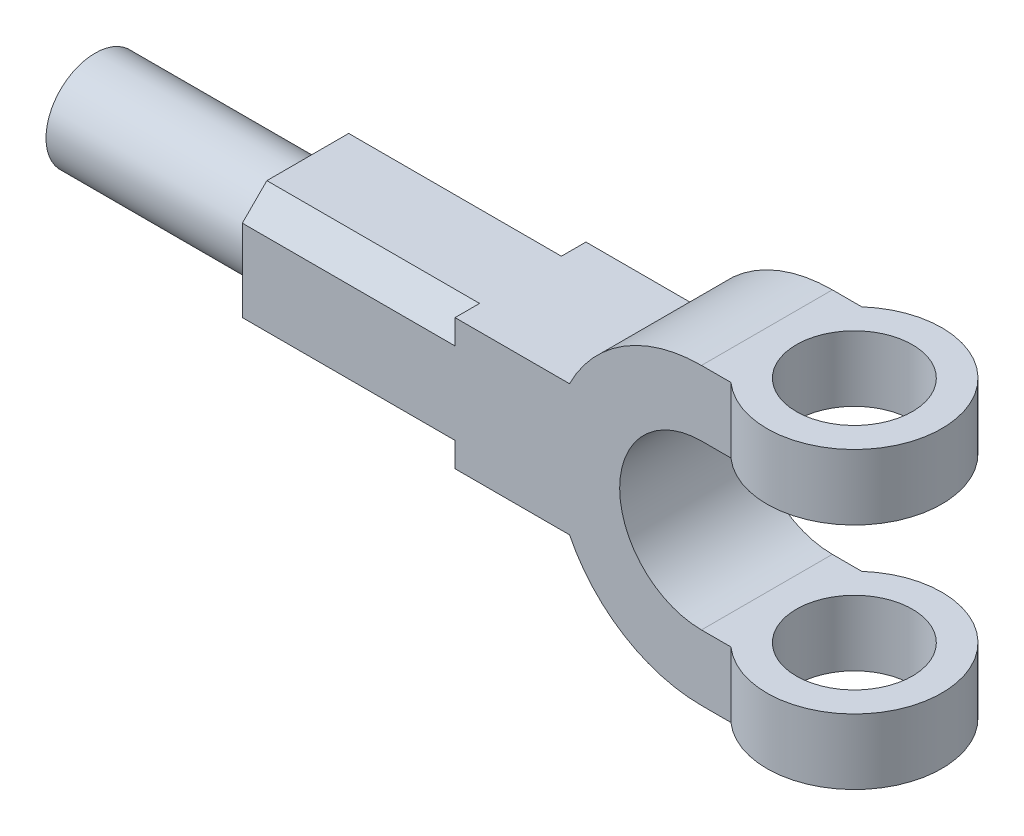
ISO-10303-21;
HEADER;
FILE_DESCRIPTION(('STEP AP214'),'2;1');
FILE_NAME('part.step','',(''),(''),'','','');
FILE_SCHEMA(('AUTOMOTIVE_DESIGN { 1 0 10303 214 1 1 1 1 }'));
ENDSEC;
DATA;
#1=APPLICATION_CONTEXT('core data for automotive mechanical design processes');
#2=APPLICATION_PROTOCOL_DEFINITION('international standard','automotive_design',2000,#1);
#3=PRODUCT_CONTEXT('',#1,'mechanical');
#4=PRODUCT('Part','Part','',(#3));
#5=PRODUCT_RELATED_PRODUCT_CATEGORY('part','',(#4));
#6=PRODUCT_DEFINITION_FORMATION('','',#4);
#7=PRODUCT_DEFINITION_CONTEXT('part definition',#1,'design');
#8=PRODUCT_DEFINITION('design','',#6,#7);
#9=PRODUCT_DEFINITION_SHAPE('','',#8);
#10=(LENGTH_UNIT() NAMED_UNIT(*) SI_UNIT(.MILLI.,.METRE.));
#11=(NAMED_UNIT(*) PLANE_ANGLE_UNIT() SI_UNIT($,.RADIAN.));
#12=(NAMED_UNIT(*) SI_UNIT($,.STERADIAN.) SOLID_ANGLE_UNIT());
#13=UNCERTAINTY_MEASURE_WITH_UNIT(LENGTH_MEASURE(1.E-05),#10,'distance_accuracy_value','');
#14=(GEOMETRIC_REPRESENTATION_CONTEXT(3) GLOBAL_UNCERTAINTY_ASSIGNED_CONTEXT((#13)) GLOBAL_UNIT_ASSIGNED_CONTEXT((#10,
#11,#12)) REPRESENTATION_CONTEXT('',''));
#15=CARTESIAN_POINT('',(0.,0.,0.));
#16=DIRECTION('',(0.,0.,1.));
#17=DIRECTION('',(1.,0.,0.));
#18=AXIS2_PLACEMENT_3D('',#15,#16,#17);
#19=CARTESIAN_POINT('',(-140.311288741493,0.,20.));
#20=DIRECTION('',(1.,0.,0.));
#21=DIRECTION('',(0.,0.,-1.));
#22=AXIS2_PLACEMENT_3D('',#19,#20,#21);
#23=PLANE('',#22);
#24=DIRECTION('',(0.,-1.,0.));
#25=VECTOR('',#24,1.);
#26=CARTESIAN_POINT('',(-140.311288741493,0.,-20.));
#27=LINE('',#26,#25);
#28=CARTESIAN_POINT('',(-140.311288741493,12.5,-20.));
#29=VERTEX_POINT('',#28);
#30=CARTESIAN_POINT('',(-140.311288741493,-12.4999999999998,-20.0000000000002));
#31=VERTEX_POINT('',#30);
#32=EDGE_CURVE('E286',#29,#31,#27,.T.);
#33=ORIENTED_EDGE('',*,*,#32,.T.);
#34=DIRECTION('',(0.,0.707106781186552,-0.707106781186543));
#35=VECTOR('',#34,1.);
#36=CARTESIAN_POINT('',(-140.311288741493,-12.4999999999998,-20.0000000000002));
#37=LINE('',#36,#35);
#38=CARTESIAN_POINT('',(-140.311288741493,-19.9999999999999,-12.5000000000002));
#39=VERTEX_POINT('',#38);
#40=EDGE_CURVE('E202',#39,#31,#37,.T.);
#41=ORIENTED_EDGE('',*,*,#40,.F.);
#42=DIRECTION('',(0.,0.,-1.));
#43=VECTOR('',#42,1.);
#44=CARTESIAN_POINT('',(-140.311288741493,-20.,20.));
#45=LINE('',#44,#43);
#46=CARTESIAN_POINT('',(-140.311288741493,-20.,12.5));
#47=VERTEX_POINT('',#46);
#48=EDGE_CURVE('E207',#47,#39,#45,.T.);
#49=ORIENTED_EDGE('',*,*,#48,.F.);
#50=DIRECTION('',(0.,-0.70710678118655,-0.707106781186545));
#51=VECTOR('',#50,1.);
#52=CARTESIAN_POINT('',(-140.311288741493,-20.,12.5));
#53=LINE('',#52,#51);
#54=CARTESIAN_POINT('',(-140.311288741493,-12.5,20.));
#55=VERTEX_POINT('',#54);
#56=EDGE_CURVE('E209',#55,#47,#53,.T.);
#57=ORIENTED_EDGE('',*,*,#56,.F.);
#58=DIRECTION('',(0.,-1.,0.));
#59=VECTOR('',#58,1.);
#60=CARTESIAN_POINT('',(-140.311288741493,0.,20.));
#61=LINE('',#60,#59);
#62=CARTESIAN_POINT('',(-140.311288741493,12.4999999999999,20.0000000000001));
#63=VERTEX_POINT('',#62);
#64=EDGE_CURVE('E308',#63,#55,#61,.T.);
#65=ORIENTED_EDGE('',*,*,#64,.F.);
#66=DIRECTION('',(0.,-0.707106781186547,0.707106781186548));
#67=VECTOR('',#66,1.);
#68=CARTESIAN_POINT('',(-140.311288741493,12.4999999999999,20.0000000000001));
#69=LINE('',#68,#67);
#70=CARTESIAN_POINT('',(-140.311288741493,20.,12.5));
#71=VERTEX_POINT('',#70);
#72=EDGE_CURVE('E223',#71,#63,#69,.T.);
#73=ORIENTED_EDGE('',*,*,#72,.F.);
#74=DIRECTION('',(0.,0.,-1.));
#75=VECTOR('',#74,1.);
#76=CARTESIAN_POINT('',(-140.311288741493,20.,20.));
#77=LINE('',#76,#75);
#78=CARTESIAN_POINT('',(-140.311288741493,20.,-12.5));
#79=VERTEX_POINT('',#78);
#80=EDGE_CURVE('E342',#71,#79,#77,.T.);
#81=ORIENTED_EDGE('',*,*,#80,.T.);
#82=DIRECTION('',(0.,0.70710678118655,0.707106781186545));
#83=VECTOR('',#82,1.);
#84=CARTESIAN_POINT('',(-140.311288741493,20.,-12.5));
#85=LINE('',#84,#83);
#86=EDGE_CURVE('E241',#29,#79,#85,.T.);
#87=ORIENTED_EDGE('',*,*,#86,.F.);
#88=EDGE_LOOP('',(#33,#41,#49,#57,#65,#73,#81,#87));
#89=FACE_BOUND('',#88,.T.);
#90=CARTESIAN_POINT('',(-140.311288741493,0.,0.));
#91=DIRECTION('',(1.,0.,0.));
#92=DIRECTION('',(0.,0.,-1.));
#93=AXIS2_PLACEMENT_3D('',#90,#91,#92);
#94=CIRCLE('',#93,15.);
#95=CARTESIAN_POINT('',(-140.311288741493,0.,-15.));
#96=VERTEX_POINT('',#95);
#97=EDGE_CURVE('E13',#96,#96,#94,.F.);
#98=ORIENTED_EDGE('',*,*,#97,.F.);
#99=EDGE_LOOP('',(#98));
#100=FACE_BOUND('',#99,.T.);
#101=ADVANCED_FACE('F50',(#89,#100),#23,.F.);
#102=CARTESIAN_POINT('',(0.,-20.,20.));
#103=DIRECTION('',(0.,-1.,0.));
#104=DIRECTION('',(1.,0.,0.));
#105=AXIS2_PLACEMENT_3D('',#102,#103,#104);
#106=PLANE('',#105);
#107=DIRECTION('',(-1.,0.,0.));
#108=VECTOR('',#107,1.);
#109=CARTESIAN_POINT('',(-75.3112887414927,-19.9999999999999,-12.5000000000002));
#110=LINE('',#109,#108);
#111=CARTESIAN_POINT('',(-75.3112887414927,-19.9999999999999,-12.5000000000002));
#112=VERTEX_POINT('',#111);
#113=EDGE_CURVE('E189',#112,#39,#110,.T.);
#114=ORIENTED_EDGE('',*,*,#113,.F.);
#115=DIRECTION('',(0.,0.,1.));
#116=VECTOR('',#115,1.);
#117=CARTESIAN_POINT('',(-75.3112887414927,-19.9999999999998,-20.0000000000002));
#118=LINE('',#117,#116);
#119=CARTESIAN_POINT('',(-75.3112887414927,-19.9999999999998,-20.0000000000002));
#120=VERTEX_POINT('',#119);
#121=EDGE_CURVE('E195',#120,#112,#118,.T.);
#122=ORIENTED_EDGE('',*,*,#121,.F.);
#123=DIRECTION('',(-1.,0.,0.));
#124=VECTOR('',#123,1.);
#125=CARTESIAN_POINT('',(0.,-20.,-20.));
#126=LINE('',#125,#124);
#127=CARTESIAN_POINT('',(-40.3112887414927,-20.,-20.));
#128=VERTEX_POINT('',#127);
#129=EDGE_CURVE('E279',#128,#120,#126,.T.);
#130=ORIENTED_EDGE('',*,*,#129,.F.);
#131=DIRECTION('',(0.,0.,-1.));
#132=VECTOR('',#131,1.);
#133=CARTESIAN_POINT('',(-40.3112887414927,-20.,20.));
#134=LINE('',#133,#132);
#135=CARTESIAN_POINT('',(-40.3112887414927,-20.,20.));
#136=VERTEX_POINT('',#135);
#137=EDGE_CURVE('E58',#136,#128,#134,.T.);
#138=ORIENTED_EDGE('',*,*,#137,.F.);
#139=DIRECTION('',(-1.,0.,0.));
#140=VECTOR('',#139,1.);
#141=CARTESIAN_POINT('',(0.,-20.,20.));
#142=LINE('',#141,#140);
#143=CARTESIAN_POINT('',(-75.3112887414927,-20.,20.));
#144=VERTEX_POINT('',#143);
#145=EDGE_CURVE('E282',#136,#144,#142,.T.);
#146=ORIENTED_EDGE('',*,*,#145,.T.);
#147=DIRECTION('',(0.,0.,1.));
#148=VECTOR('',#147,1.);
#149=CARTESIAN_POINT('',(-75.3112887414927,-20.,12.5));
#150=LINE('',#149,#148);
#151=CARTESIAN_POINT('',(-75.3112887414927,-20.,12.5));
#152=VERTEX_POINT('',#151);
#153=EDGE_CURVE('E73',#152,#144,#150,.T.);
#154=ORIENTED_EDGE('',*,*,#153,.F.);
#155=DIRECTION('',(-1.,0.,0.));
#156=VECTOR('',#155,1.);
#157=CARTESIAN_POINT('',(-75.3112887414927,-20.,12.5));
#158=LINE('',#157,#156);
#159=EDGE_CURVE('E221',#152,#47,#158,.T.);
#160=ORIENTED_EDGE('',*,*,#159,.T.);
#161=ORIENTED_EDGE('',*,*,#48,.T.);
#162=EDGE_LOOP('',(#114,#122,#130,#138,#146,#154,#160,#161));
#163=FACE_BOUND('',#162,.T.);
#164=ADVANCED_FACE('F52',(#163),#106,.T.);
#165=CARTESIAN_POINT('',(0.,0.,20.));
#166=DIRECTION('',(0.,0.,-1.));
#167=DIRECTION('',(-1.,0.,0.));
#168=AXIS2_PLACEMENT_3D('',#165,#166,#167);
#169=CYLINDRICAL_SURFACE('',#168,45.);
#170=CARTESIAN_POINT('',(0.,0.,-20.));
#171=DIRECTION('',(0.,0.,1.));
#172=DIRECTION('',(1.,0.,0.));
#173=AXIS2_PLACEMENT_3D('',#170,#171,#172);
#174=CIRCLE('',#173,45.);
#175=CARTESIAN_POINT('',(0.,-45.,-20.));
#176=VERTEX_POINT('',#175);
#177=EDGE_CURVE('E312',#128,#176,#174,.T.);
#178=ORIENTED_EDGE('',*,*,#177,.T.);
#179=DIRECTION('',(0.,0.,-1.));
#180=VECTOR('',#179,1.);
#181=CARTESIAN_POINT('',(0.,-45.,20.));
#182=LINE('',#181,#180);
#183=CARTESIAN_POINT('',(0.,-45.,20.));
#184=VERTEX_POINT('',#183);
#185=EDGE_CURVE('E353',#184,#176,#182,.T.);
#186=ORIENTED_EDGE('',*,*,#185,.F.);
#187=CARTESIAN_POINT('',(0.,0.,20.));
#188=DIRECTION('',(0.,0.,1.));
#189=DIRECTION('',(1.,0.,0.));
#190=AXIS2_PLACEMENT_3D('',#187,#188,#189);
#191=CIRCLE('',#190,45.);
#192=EDGE_CURVE('E285',#136,#184,#191,.T.);
#193=ORIENTED_EDGE('',*,*,#192,.F.);
#194=ORIENTED_EDGE('',*,*,#137,.T.);
#195=EDGE_LOOP('',(#178,#186,#193,#194));
#196=FACE_BOUND('',#195,.T.);
#197=ADVANCED_FACE('F357',(#196),#169,.T.);
#198=CARTESIAN_POINT('',(0.,-45.,20.));
#199=DIRECTION('',(0.,1.,0.));
#200=DIRECTION('',(0.,0.,1.));
#201=AXIS2_PLACEMENT_3D('',#198,#199,#200);
#202=PLANE('',#201);
#203=CARTESIAN_POINT('',(26.7222222222222,-45.,0.));
#204=DIRECTION('',(0.,1.,0.));
#205=DIRECTION('',(0.,0.,1.));
#206=AXIS2_PLACEMENT_3D('',#203,#204,#205);
#207=CIRCLE('',#206,17.7222222222222);
#208=CARTESIAN_POINT('',(26.7222222222222,-45.,17.7222222222222));
#209=VERTEX_POINT('',#208);
#210=EDGE_CURVE('E256',#209,#209,#207,.T.);
#211=ORIENTED_EDGE('',*,*,#210,.T.);
#212=EDGE_LOOP('',(#211));
#213=FACE_BOUND('',#212,.T.);
#214=CARTESIAN_POINT('',(26.7222222222222,-45.,0.));
#215=DIRECTION('',(0.,1.,0.));
#216=DIRECTION('',(0.,0.,1.));
#217=AXIS2_PLACEMENT_3D('',#214,#215,#216);
#218=CIRCLE('',#217,26.7222222222222);
#219=CARTESIAN_POINT('',(8.99999999999999,-45.,20.));
#220=VERTEX_POINT('',#219);
#221=CARTESIAN_POINT('',(8.99999999999999,-45.,-20.));
#222=VERTEX_POINT('',#221);
#223=EDGE_CURVE('E261',#220,#222,#218,.T.);
#224=ORIENTED_EDGE('',*,*,#223,.F.);
#225=DIRECTION('',(1.,0.,0.));
#226=VECTOR('',#225,1.);
#227=CARTESIAN_POINT('',(0.,-45.,20.));
#228=LINE('',#227,#226);
#229=EDGE_CURVE('E288',#184,#220,#228,.T.);
#230=ORIENTED_EDGE('',*,*,#229,.F.);
#231=ORIENTED_EDGE('',*,*,#185,.T.);
#232=DIRECTION('',(1.,0.,0.));
#233=VECTOR('',#232,1.);
#234=CARTESIAN_POINT('',(0.,-45.,-20.));
#235=LINE('',#234,#233);
#236=EDGE_CURVE('E315',#176,#222,#235,.T.);
#237=ORIENTED_EDGE('',*,*,#236,.T.);
#238=EDGE_LOOP('',(#224,#230,#231,#237));
#239=FACE_BOUND('',#238,.T.);
#240=ADVANCED_FACE('F366',(#213,#239),#202,.F.);
#241=CARTESIAN_POINT('',(0.,-25.,20.));
#242=DIRECTION('',(0.,-1.,0.));
#243=DIRECTION('',(0.,0.,-1.));
#244=AXIS2_PLACEMENT_3D('',#241,#242,#243);
#245=PLANE('',#244);
#246=CARTESIAN_POINT('',(26.7222222222222,-25.,0.));
#247=DIRECTION('',(0.,1.,0.));
#248=DIRECTION('',(0.,0.,1.));
#249=AXIS2_PLACEMENT_3D('',#246,#247,#248);
#250=CIRCLE('',#249,17.7222222222222);
#251=CARTESIAN_POINT('',(26.7222222222222,-25.,17.7222222222222));
#252=VERTEX_POINT('',#251);
#253=EDGE_CURVE('E258',#252,#252,#250,.T.);
#254=ORIENTED_EDGE('',*,*,#253,.F.);
#255=EDGE_LOOP('',(#254));
#256=FACE_BOUND('',#255,.T.);
#257=CARTESIAN_POINT('',(26.7222222222222,-25.,0.));
#258=DIRECTION('',(0.,1.,0.));
#259=DIRECTION('',(0.,0.,1.));
#260=AXIS2_PLACEMENT_3D('',#257,#258,#259);
#261=CIRCLE('',#260,26.7222222222222);
#262=CARTESIAN_POINT('',(8.99999999999999,-25.,20.));
#263=VERTEX_POINT('',#262);
#264=CARTESIAN_POINT('',(9.00000000000001,-25.,-20.));
#265=VERTEX_POINT('',#264);
#266=EDGE_CURVE('E264',#263,#265,#261,.T.);
#267=ORIENTED_EDGE('',*,*,#266,.T.);
#268=DIRECTION('',(-1.,0.,0.));
#269=VECTOR('',#268,1.);
#270=CARTESIAN_POINT('',(0.,-25.,-20.));
#271=LINE('',#270,#269);
#272=CARTESIAN_POINT('',(0.,-25.,-20.));
#273=VERTEX_POINT('',#272);
#274=EDGE_CURVE('E320',#265,#273,#271,.T.);
#275=ORIENTED_EDGE('',*,*,#274,.T.);
#276=DIRECTION('',(0.,0.,-1.));
#277=VECTOR('',#276,1.);
#278=CARTESIAN_POINT('',(0.,-25.,20.));
#279=LINE('',#278,#277);
#280=CARTESIAN_POINT('',(0.,-25.,20.));
#281=VERTEX_POINT('',#280);
#282=EDGE_CURVE('E351',#281,#273,#279,.T.);
#283=ORIENTED_EDGE('',*,*,#282,.F.);
#284=DIRECTION('',(-1.,0.,0.));
#285=VECTOR('',#284,1.);
#286=CARTESIAN_POINT('',(0.,-25.,20.));
#287=LINE('',#286,#285);
#288=EDGE_CURVE('E292',#263,#281,#287,.T.);
#289=ORIENTED_EDGE('',*,*,#288,.F.);
#290=EDGE_LOOP('',(#267,#275,#283,#289));
#291=FACE_BOUND('',#290,.T.);
#292=ADVANCED_FACE('F377',(#256,#291),#245,.F.);
#293=CARTESIAN_POINT('',(0.,0.,20.));
#294=DIRECTION('',(0.,0.,-1.));
#295=DIRECTION('',(-1.,0.,0.));
#296=AXIS2_PLACEMENT_3D('',#293,#294,#295);
#297=CYLINDRICAL_SURFACE('',#296,25.);
#298=CARTESIAN_POINT('',(0.,0.,-20.));
#299=DIRECTION('',(0.,0.,1.));
#300=DIRECTION('',(1.,0.,0.));
#301=AXIS2_PLACEMENT_3D('',#298,#299,#300);
#302=CIRCLE('',#301,25.);
#303=CARTESIAN_POINT('',(0.,25.,-20.));
#304=VERTEX_POINT('',#303);
#305=EDGE_CURVE('E323',#304,#273,#302,.T.);
#306=ORIENTED_EDGE('',*,*,#305,.F.);
#307=DIRECTION('',(0.,0.,-1.));
#308=VECTOR('',#307,1.);
#309=CARTESIAN_POINT('',(0.,25.,20.));
#310=LINE('',#309,#308);
#311=CARTESIAN_POINT('',(0.,25.,20.));
#312=VERTEX_POINT('',#311);
#313=EDGE_CURVE('E349',#312,#304,#310,.T.);
#314=ORIENTED_EDGE('',*,*,#313,.F.);
#315=CARTESIAN_POINT('',(0.,0.,20.));
#316=DIRECTION('',(0.,0.,1.));
#317=DIRECTION('',(1.,0.,0.));
#318=AXIS2_PLACEMENT_3D('',#315,#316,#317);
#319=CIRCLE('',#318,25.);
#320=EDGE_CURVE('E294',#312,#281,#319,.T.);
#321=ORIENTED_EDGE('',*,*,#320,.T.);
#322=ORIENTED_EDGE('',*,*,#282,.T.);
#323=EDGE_LOOP('',(#306,#314,#321,#322));
#324=FACE_BOUND('',#323,.T.);
#325=ADVANCED_FACE('F384',(#324),#297,.F.);
#326=CARTESIAN_POINT('',(0.,25.,20.));
#327=DIRECTION('',(0.,1.,0.));
#328=DIRECTION('',(0.,0.,1.));
#329=AXIS2_PLACEMENT_3D('',#326,#327,#328);
#330=PLANE('',#329);
#331=ORIENTED_EDGE('',*,*,#313,.T.);
#332=DIRECTION('',(1.,0.,0.));
#333=VECTOR('',#332,1.);
#334=CARTESIAN_POINT('',(0.,25.,-20.));
#335=LINE('',#334,#333);
#336=CARTESIAN_POINT('',(8.99999999999999,25.,-20.));
#337=VERTEX_POINT('',#336);
#338=EDGE_CURVE('E326',#304,#337,#335,.T.);
#339=ORIENTED_EDGE('',*,*,#338,.T.);
#340=CARTESIAN_POINT('',(26.7222222222222,25.,0.));
#341=DIRECTION('',(0.,1.,0.));
#342=DIRECTION('',(0.,0.,1.));
#343=AXIS2_PLACEMENT_3D('',#340,#341,#342);
#344=CIRCLE('',#343,26.7222222222222);
#345=CARTESIAN_POINT('',(8.99999999999999,25.,20.));
#346=VERTEX_POINT('',#345);
#347=EDGE_CURVE('E276',#346,#337,#344,.T.);
#348=ORIENTED_EDGE('',*,*,#347,.F.);
#349=DIRECTION('',(1.,0.,0.));
#350=VECTOR('',#349,1.);
#351=CARTESIAN_POINT('',(0.,25.,20.));
#352=LINE('',#351,#350);
#353=EDGE_CURVE('E297',#312,#346,#352,.T.);
#354=ORIENTED_EDGE('',*,*,#353,.F.);
#355=EDGE_LOOP('',(#331,#339,#348,#354));
#356=FACE_BOUND('',#355,.T.);
#357=CARTESIAN_POINT('',(26.7222222222222,25.,0.));
#358=DIRECTION('',(0.,1.,0.));
#359=DIRECTION('',(0.,0.,1.));
#360=AXIS2_PLACEMENT_3D('',#357,#358,#359);
#361=CIRCLE('',#360,17.7222222222222);
#362=CARTESIAN_POINT('',(26.7222222222222,25.,17.7222222222222));
#363=VERTEX_POINT('',#362);
#364=EDGE_CURVE('E270',#363,#363,#361,.T.);
#365=ORIENTED_EDGE('',*,*,#364,.T.);
#366=EDGE_LOOP('',(#365));
#367=FACE_BOUND('',#366,.T.);
#368=ADVANCED_FACE('F388',(#356,#367),#330,.F.);
#369=CARTESIAN_POINT('',(0.,45.,20.));
#370=DIRECTION('',(0.,-1.,0.));
#371=DIRECTION('',(0.,0.,-1.));
#372=AXIS2_PLACEMENT_3D('',#369,#370,#371);
#373=PLANE('',#372);
#374=CARTESIAN_POINT('',(26.7222222222222,45.,0.));
#375=DIRECTION('',(0.,1.,0.));
#376=DIRECTION('',(0.,0.,1.));
#377=AXIS2_PLACEMENT_3D('',#374,#375,#376);
#378=CIRCLE('',#377,17.7222222222222);
#379=CARTESIAN_POINT('',(26.7222222222222,45.,17.7222222222222));
#380=VERTEX_POINT('',#379);
#381=EDGE_CURVE('E267',#380,#380,#378,.T.);
#382=ORIENTED_EDGE('',*,*,#381,.F.);
#383=EDGE_LOOP('',(#382));
#384=FACE_BOUND('',#383,.T.);
#385=DIRECTION('',(-1.,0.,0.));
#386=VECTOR('',#385,1.);
#387=CARTESIAN_POINT('',(0.,45.,-20.));
#388=LINE('',#387,#386);
#389=CARTESIAN_POINT('',(9.00000000000001,45.,-20.));
#390=VERTEX_POINT('',#389);
#391=CARTESIAN_POINT('',(0.,45.,-20.));
#392=VERTEX_POINT('',#391);
#393=EDGE_CURVE('E331',#390,#392,#388,.T.);
#394=ORIENTED_EDGE('',*,*,#393,.T.);
#395=DIRECTION('',(0.,0.,-1.));
#396=VECTOR('',#395,1.);
#397=CARTESIAN_POINT('',(0.,45.,20.));
#398=LINE('',#397,#396);
#399=CARTESIAN_POINT('',(0.,45.,20.));
#400=VERTEX_POINT('',#399);
#401=EDGE_CURVE('E347',#400,#392,#398,.T.);
#402=ORIENTED_EDGE('',*,*,#401,.F.);
#403=DIRECTION('',(-1.,0.,0.));
#404=VECTOR('',#403,1.);
#405=CARTESIAN_POINT('',(0.,45.,20.));
#406=LINE('',#405,#404);
#407=CARTESIAN_POINT('',(8.99999999999999,45.,20.));
#408=VERTEX_POINT('',#407);
#409=EDGE_CURVE('E301',#408,#400,#406,.T.);
#410=ORIENTED_EDGE('',*,*,#409,.F.);
#411=CARTESIAN_POINT('',(26.7222222222222,45.,0.));
#412=DIRECTION('',(0.,1.,0.));
#413=DIRECTION('',(0.,0.,1.));
#414=AXIS2_PLACEMENT_3D('',#411,#412,#413);
#415=CIRCLE('',#414,26.7222222222222);
#416=EDGE_CURVE('E273',#408,#390,#415,.T.);
#417=ORIENTED_EDGE('',*,*,#416,.T.);
#418=EDGE_LOOP('',(#394,#402,#410,#417));
#419=FACE_BOUND('',#418,.T.);
#420=ADVANCED_FACE('F397',(#384,#419),#373,.F.);
#421=CARTESIAN_POINT('',(0.,0.,20.));
#422=DIRECTION('',(0.,0.,-1.));
#423=DIRECTION('',(-1.,0.,0.));
#424=AXIS2_PLACEMENT_3D('',#421,#422,#423);
#425=CYLINDRICAL_SURFACE('',#424,45.);
#426=CARTESIAN_POINT('',(0.,0.,-20.));
#427=DIRECTION('',(0.,0.,1.));
#428=DIRECTION('',(1.,0.,0.));
#429=AXIS2_PLACEMENT_3D('',#426,#427,#428);
#430=CIRCLE('',#429,45.);
#431=CARTESIAN_POINT('',(-40.3112887414927,20.,-20.));
#432=VERTEX_POINT('',#431);
#433=EDGE_CURVE('E334',#392,#432,#430,.T.);
#434=ORIENTED_EDGE('',*,*,#433,.T.);
#435=DIRECTION('',(0.,0.,-1.));
#436=VECTOR('',#435,1.);
#437=CARTESIAN_POINT('',(-40.3112887414927,20.,20.));
#438=LINE('',#437,#436);
#439=CARTESIAN_POINT('',(-40.3112887414927,20.,20.));
#440=VERTEX_POINT('',#439);
#441=EDGE_CURVE('E344',#440,#432,#438,.T.);
#442=ORIENTED_EDGE('',*,*,#441,.F.);
#443=CARTESIAN_POINT('',(0.,0.,20.));
#444=DIRECTION('',(0.,0.,1.));
#445=DIRECTION('',(1.,0.,0.));
#446=AXIS2_PLACEMENT_3D('',#443,#444,#445);
#447=CIRCLE('',#446,45.);
#448=EDGE_CURVE('E303',#400,#440,#447,.T.);
#449=ORIENTED_EDGE('',*,*,#448,.F.);
#450=ORIENTED_EDGE('',*,*,#401,.T.);
#451=EDGE_LOOP('',(#434,#442,#449,#450));
#452=FACE_BOUND('',#451,.T.);
#453=ADVANCED_FACE('F402',(#452),#425,.T.);
#454=CARTESIAN_POINT('',(0.,20.,20.));
#455=DIRECTION('',(0.,-1.,0.));
#456=DIRECTION('',(1.,0.,0.));
#457=AXIS2_PLACEMENT_3D('',#454,#455,#456);
#458=PLANE('',#457);
#459=ORIENTED_EDGE('',*,*,#80,.F.);
#460=DIRECTION('',(-1.,0.,0.));
#461=VECTOR('',#460,1.);
#462=CARTESIAN_POINT('',(-75.3112887414927,20.,12.5));
#463=LINE('',#462,#461);
#464=CARTESIAN_POINT('',(-75.3112887414927,20.,12.5));
#465=VERTEX_POINT('',#464);
#466=EDGE_CURVE('E232',#465,#71,#463,.T.);
#467=ORIENTED_EDGE('',*,*,#466,.F.);
#468=DIRECTION('',(0.,0.,-1.));
#469=VECTOR('',#468,1.);
#470=CARTESIAN_POINT('',(-75.3112887414927,19.9999999999999,20.0000000000001));
#471=LINE('',#470,#469);
#472=CARTESIAN_POINT('',(-75.3112887414927,19.9999999999999,20.0000000000001));
#473=VERTEX_POINT('',#472);
#474=EDGE_CURVE('E225',#473,#465,#471,.T.);
#475=ORIENTED_EDGE('',*,*,#474,.F.);
#476=DIRECTION('',(-1.,0.,0.));
#477=VECTOR('',#476,1.);
#478=CARTESIAN_POINT('',(0.,20.,20.));
#479=LINE('',#478,#477);
#480=EDGE_CURVE('E305',#440,#473,#479,.T.);
#481=ORIENTED_EDGE('',*,*,#480,.F.);
#482=ORIENTED_EDGE('',*,*,#441,.T.);
#483=DIRECTION('',(-1.,0.,0.));
#484=VECTOR('',#483,1.);
#485=CARTESIAN_POINT('',(0.,20.,-20.));
#486=LINE('',#485,#484);
#487=CARTESIAN_POINT('',(-75.3112887414927,20.,-20.));
#488=VERTEX_POINT('',#487);
#489=EDGE_CURVE('E336',#432,#488,#486,.T.);
#490=ORIENTED_EDGE('',*,*,#489,.T.);
#491=DIRECTION('',(0.,0.,-1.));
#492=VECTOR('',#491,1.);
#493=CARTESIAN_POINT('',(-75.3112887414927,20.,-12.5));
#494=LINE('',#493,#492);
#495=CARTESIAN_POINT('',(-75.3112887414927,20.,-12.5));
#496=VERTEX_POINT('',#495);
#497=EDGE_CURVE('E248',#496,#488,#494,.T.);
#498=ORIENTED_EDGE('',*,*,#497,.F.);
#499=DIRECTION('',(-1.,0.,0.));
#500=VECTOR('',#499,1.);
#501=CARTESIAN_POINT('',(-75.3112887414927,20.,-12.5));
#502=LINE('',#501,#500);
#503=EDGE_CURVE('E253',#496,#79,#502,.T.);
#504=ORIENTED_EDGE('',*,*,#503,.T.);
#505=EDGE_LOOP('',(#459,#467,#475,#481,#482,#490,#498,#504));
#506=FACE_BOUND('',#505,.T.);
#507=ADVANCED_FACE('F408',(#506),#458,.F.);
#508=CARTESIAN_POINT('',(0.,0.,20.));
#509=DIRECTION('',(0.,0.,1.));
#510=DIRECTION('',(1.,0.,0.));
#511=AXIS2_PLACEMENT_3D('',#508,#509,#510);
#512=PLANE('',#511);
#513=DIRECTION('',(-1.,0.,0.));
#514=VECTOR('',#513,1.);
#515=CARTESIAN_POINT('',(-75.3112887414927,-12.5,20.));
#516=LINE('',#515,#514);
#517=CARTESIAN_POINT('',(-75.3112887414927,-12.5,20.));
#518=VERTEX_POINT('',#517);
#519=EDGE_CURVE('E219',#518,#55,#516,.T.);
#520=ORIENTED_EDGE('',*,*,#519,.F.);
#521=DIRECTION('',(0.,1.,0.));
#522=VECTOR('',#521,1.);
#523=CARTESIAN_POINT('',(-75.3112887414927,-20.,20.));
#524=LINE('',#523,#522);
#525=EDGE_CURVE('E214',#144,#518,#524,.T.);
#526=ORIENTED_EDGE('',*,*,#525,.F.);
#527=ORIENTED_EDGE('',*,*,#145,.F.);
#528=ORIENTED_EDGE('',*,*,#192,.T.);
#529=ORIENTED_EDGE('',*,*,#229,.T.);
#530=DIRECTION('',(0.,1.,0.));
#531=VECTOR('',#530,1.);
#532=CARTESIAN_POINT('',(8.99999999999999,0.,20.));
#533=LINE('',#532,#531);
#534=EDGE_CURVE('E290',#220,#263,#533,.T.);
#535=ORIENTED_EDGE('',*,*,#534,.T.);
#536=ORIENTED_EDGE('',*,*,#288,.T.);
#537=ORIENTED_EDGE('',*,*,#320,.F.);
#538=ORIENTED_EDGE('',*,*,#353,.T.);
#539=DIRECTION('',(0.,1.,0.));
#540=VECTOR('',#539,1.);
#541=CARTESIAN_POINT('',(8.99999999999999,0.,20.));
#542=LINE('',#541,#540);
#543=EDGE_CURVE('E299',#346,#408,#542,.T.);
#544=ORIENTED_EDGE('',*,*,#543,.T.);
#545=ORIENTED_EDGE('',*,*,#409,.T.);
#546=ORIENTED_EDGE('',*,*,#448,.T.);
#547=ORIENTED_EDGE('',*,*,#480,.T.);
#548=DIRECTION('',(0.,1.,0.));
#549=VECTOR('',#548,1.);
#550=CARTESIAN_POINT('',(-75.3112887414927,12.4999999999999,20.0000000000001));
#551=LINE('',#550,#549);
#552=CARTESIAN_POINT('',(-75.3112887414927,12.4999999999999,20.));
#553=VERTEX_POINT('',#552);
#554=EDGE_CURVE('E230',#553,#473,#551,.T.);
#555=ORIENTED_EDGE('',*,*,#554,.F.);
#556=DIRECTION('',(-1.,0.,0.));
#557=VECTOR('',#556,1.);
#558=CARTESIAN_POINT('',(-75.3112887414927,12.4999999999999,20.0000000000001));
#559=LINE('',#558,#557);
#560=EDGE_CURVE('E234',#553,#63,#559,.T.);
#561=ORIENTED_EDGE('',*,*,#560,.T.);
#562=ORIENTED_EDGE('',*,*,#64,.T.);
#563=EDGE_LOOP('',(#520,#526,#527,#528,#529,#535,#536,#537,#538,#544,#545,#546,#547,#555,#561,#562));
#564=FACE_BOUND('',#563,.T.);
#565=ADVANCED_FACE('F371',(#564),#512,.T.);
#566=CARTESIAN_POINT('',(0.,0.,-20.));
#567=DIRECTION('',(0.,0.,1.));
#568=DIRECTION('',(1.,0.,0.));
#569=AXIS2_PLACEMENT_3D('',#566,#567,#568);
#570=PLANE('',#569);
#571=DIRECTION('',(0.,-1.,0.));
#572=VECTOR('',#571,1.);
#573=CARTESIAN_POINT('',(-75.3112887414927,-12.4999999999998,-20.0000000000002));
#574=LINE('',#573,#572);
#575=CARTESIAN_POINT('',(-75.3112887414927,-12.4999999999998,-20.));
#576=VERTEX_POINT('',#575);
#577=EDGE_CURVE('E194',#576,#120,#574,.T.);
#578=ORIENTED_EDGE('',*,*,#577,.F.);
#579=DIRECTION('',(-1.,0.,0.));
#580=VECTOR('',#579,1.);
#581=CARTESIAN_POINT('',(-75.3112887414927,-12.4999999999998,-20.0000000000002));
#582=LINE('',#581,#580);
#583=EDGE_CURVE('E192',#576,#31,#582,.T.);
#584=ORIENTED_EDGE('',*,*,#583,.T.);
#585=ORIENTED_EDGE('',*,*,#32,.F.);
#586=DIRECTION('',(-1.,0.,0.));
#587=VECTOR('',#586,1.);
#588=CARTESIAN_POINT('',(-75.3112887414927,12.5,-20.));
#589=LINE('',#588,#587);
#590=CARTESIAN_POINT('',(-75.3112887414927,12.5,-20.));
#591=VERTEX_POINT('',#590);
#592=EDGE_CURVE('E250',#591,#29,#589,.T.);
#593=ORIENTED_EDGE('',*,*,#592,.F.);
#594=DIRECTION('',(0.,-1.,0.));
#595=VECTOR('',#594,1.);
#596=CARTESIAN_POINT('',(-75.3112887414927,20.,-20.));
#597=LINE('',#596,#595);
#598=EDGE_CURVE('E242',#488,#591,#597,.T.);
#599=ORIENTED_EDGE('',*,*,#598,.F.);
#600=ORIENTED_EDGE('',*,*,#489,.F.);
#601=ORIENTED_EDGE('',*,*,#433,.F.);
#602=ORIENTED_EDGE('',*,*,#393,.F.);
#603=DIRECTION('',(0.,1.,0.));
#604=VECTOR('',#603,1.);
#605=CARTESIAN_POINT('',(8.99999999999999,0.,-20.));
#606=LINE('',#605,#604);
#607=EDGE_CURVE('E328',#337,#390,#606,.T.);
#608=ORIENTED_EDGE('',*,*,#607,.F.);
#609=ORIENTED_EDGE('',*,*,#338,.F.);
#610=ORIENTED_EDGE('',*,*,#305,.T.);
#611=ORIENTED_EDGE('',*,*,#274,.F.);
#612=DIRECTION('',(0.,1.,0.));
#613=VECTOR('',#612,1.);
#614=CARTESIAN_POINT('',(8.99999999999999,0.,-20.));
#615=LINE('',#614,#613);
#616=EDGE_CURVE('E317',#222,#265,#615,.T.);
#617=ORIENTED_EDGE('',*,*,#616,.F.);
#618=ORIENTED_EDGE('',*,*,#236,.F.);
#619=ORIENTED_EDGE('',*,*,#177,.F.);
#620=ORIENTED_EDGE('',*,*,#129,.T.);
#621=EDGE_LOOP('',(#578,#584,#585,#593,#599,#600,#601,#602,#608,#609,#610,#611,#617,#618,#619,#620));
#622=FACE_BOUND('',#621,.T.);
#623=ADVANCED_FACE('F362',(#622),#570,.F.);
#624=CARTESIAN_POINT('',(26.7222222222222,25.,0.));
#625=DIRECTION('',(0.,1.,0.));
#626=DIRECTION('',(0.,0.,1.));
#627=AXIS2_PLACEMENT_3D('',#624,#625,#626);
#628=CYLINDRICAL_SURFACE('',#627,26.7222222222222);
#629=ORIENTED_EDGE('',*,*,#416,.F.);
#630=ORIENTED_EDGE('',*,*,#543,.F.);
#631=ORIENTED_EDGE('',*,*,#347,.T.);
#632=ORIENTED_EDGE('',*,*,#607,.T.);
#633=EDGE_LOOP('',(#629,#630,#631,#632));
#634=FACE_BOUND('',#633,.T.);
#635=ADVANCED_FACE('F393',(#634),#628,.T.);
#636=CARTESIAN_POINT('',(26.7222222222222,25.,0.));
#637=DIRECTION('',(0.,1.,0.));
#638=DIRECTION('',(0.,0.,1.));
#639=AXIS2_PLACEMENT_3D('',#636,#637,#638);
#640=CYLINDRICAL_SURFACE('',#639,17.7222222222222);
#641=ORIENTED_EDGE('',*,*,#381,.T.);
#642=EDGE_LOOP('',(#641));
#643=FACE_BOUND('',#642,.T.);
#644=ORIENTED_EDGE('',*,*,#364,.F.);
#645=EDGE_LOOP('',(#644));
#646=FACE_BOUND('',#645,.T.);
#647=ADVANCED_FACE('F505',(#643,#646),#640,.F.);
#648=CARTESIAN_POINT('',(26.7222222222222,-25.,0.));
#649=DIRECTION('',(0.,-1.,0.));
#650=DIRECTION('',(0.,0.,-1.));
#651=AXIS2_PLACEMENT_3D('',#648,#649,#650);
#652=CYLINDRICAL_SURFACE('',#651,26.7222222222222);
#653=ORIENTED_EDGE('',*,*,#534,.F.);
#654=ORIENTED_EDGE('',*,*,#223,.T.);
#655=ORIENTED_EDGE('',*,*,#616,.T.);
#656=ORIENTED_EDGE('',*,*,#266,.F.);
#657=EDGE_LOOP('',(#653,#654,#655,#656));
#658=FACE_BOUND('',#657,.T.);
#659=ADVANCED_FACE('F375',(#658),#652,.T.);
#660=CARTESIAN_POINT('',(26.7222222222222,-25.,0.));
#661=DIRECTION('',(0.,-1.,0.));
#662=DIRECTION('',(0.,0.,-1.));
#663=AXIS2_PLACEMENT_3D('',#660,#661,#662);
#664=CYLINDRICAL_SURFACE('',#663,17.7222222222222);
#665=ORIENTED_EDGE('',*,*,#253,.T.);
#666=EDGE_LOOP('',(#665));
#667=FACE_BOUND('',#666,.T.);
#668=ORIENTED_EDGE('',*,*,#210,.F.);
#669=EDGE_LOOP('',(#668));
#670=FACE_BOUND('',#669,.T.);
#671=ADVANCED_FACE('F519',(#667,#670),#664,.F.);
#672=CARTESIAN_POINT('',(-75.3112887414927,20.,-12.5));
#673=DIRECTION('',(0.,-0.707106781186545,0.70710678118655));
#674=DIRECTION('',(0.,-0.70710678118655,-0.707106781186545));
#675=AXIS2_PLACEMENT_3D('',#672,#673,#674);
#676=PLANE('',#675);
#677=ORIENTED_EDGE('',*,*,#86,.T.);
#678=ORIENTED_EDGE('',*,*,#503,.F.);
#679=DIRECTION('',(0.,0.70710678118655,0.707106781186545));
#680=VECTOR('',#679,1.);
#681=CARTESIAN_POINT('',(-75.3112887414927,20.,-12.5));
#682=LINE('',#681,#680);
#683=EDGE_CURVE('E245',#591,#496,#682,.T.);
#684=ORIENTED_EDGE('',*,*,#683,.F.);
#685=ORIENTED_EDGE('',*,*,#592,.T.);
#686=EDGE_LOOP('',(#677,#678,#684,#685));
#687=FACE_BOUND('',#686,.T.);
#688=ADVANCED_FACE('F526',(#687),#676,.F.);
#689=CARTESIAN_POINT('',(-75.3112887414927,0.,0.));
#690=DIRECTION('',(1.,0.,0.));
#691=DIRECTION('',(0.,0.,-1.));
#692=AXIS2_PLACEMENT_3D('',#689,#690,#691);
#693=PLANE('',#692);
#694=ORIENTED_EDGE('',*,*,#598,.T.);
#695=ORIENTED_EDGE('',*,*,#683,.T.);
#696=ORIENTED_EDGE('',*,*,#497,.T.);
#697=EDGE_LOOP('',(#694,#695,#696));
#698=FACE_BOUND('',#697,.T.);
#699=ADVANCED_FACE('F534',(#698),#693,.F.);
#700=CARTESIAN_POINT('',(-205.311288741493,0.,0.));
#701=DIRECTION('',(1.,0.,0.));
#702=DIRECTION('',(0.,0.,-1.));
#703=AXIS2_PLACEMENT_3D('',#700,#701,#702);
#704=CYLINDRICAL_SURFACE('',#703,15.);
#705=CARTESIAN_POINT('',(-205.311288741493,0.,0.));
#706=DIRECTION('',(-1.,0.,0.));
#707=DIRECTION('',(0.,0.,1.));
#708=AXIS2_PLACEMENT_3D('',#705,#706,#707);
#709=CIRCLE('',#708,15.);
#710=CARTESIAN_POINT('',(-205.311288741493,0.,15.));
#711=VERTEX_POINT('',#710);
#712=EDGE_CURVE('E237',#711,#711,#709,.T.);
#713=ORIENTED_EDGE('',*,*,#712,.F.);
#714=EDGE_LOOP('',(#713));
#715=FACE_BOUND('',#714,.T.);
#716=ORIENTED_EDGE('',*,*,#97,.T.);
#717=EDGE_LOOP('',(#716));
#718=FACE_BOUND('',#717,.T.);
#719=ADVANCED_FACE('F542',(#715,#718),#704,.T.);
#720=CARTESIAN_POINT('',(-205.311288741493,0.,0.));
#721=DIRECTION('',(-1.,0.,0.));
#722=DIRECTION('',(0.,0.,1.));
#723=AXIS2_PLACEMENT_3D('',#720,#721,#722);
#724=PLANE('',#723);
#725=ORIENTED_EDGE('',*,*,#712,.T.);
#726=EDGE_LOOP('',(#725));
#727=FACE_BOUND('',#726,.T.);
#728=ADVANCED_FACE('F550',(#727),#724,.T.);
#729=CARTESIAN_POINT('',(-75.3112887414927,12.4999999999999,20.0000000000001));
#730=DIRECTION('',(0.,-0.707106781186548,-0.707106781186547));
#731=DIRECTION('',(0.,0.707106781186547,-0.707106781186548));
#732=AXIS2_PLACEMENT_3D('',#729,#730,#731);
#733=PLANE('',#732);
#734=ORIENTED_EDGE('',*,*,#72,.T.);
#735=ORIENTED_EDGE('',*,*,#560,.F.);
#736=DIRECTION('',(0.,-0.707106781186547,0.707106781186548));
#737=VECTOR('',#736,1.);
#738=CARTESIAN_POINT('',(-75.3112887414927,12.4999999999999,20.0000000000001));
#739=LINE('',#738,#737);
#740=EDGE_CURVE('E228',#465,#553,#739,.T.);
#741=ORIENTED_EDGE('',*,*,#740,.F.);
#742=ORIENTED_EDGE('',*,*,#466,.T.);
#743=EDGE_LOOP('',(#734,#735,#741,#742));
#744=FACE_BOUND('',#743,.T.);
#745=ADVANCED_FACE('F415',(#744),#733,.F.);
#746=CARTESIAN_POINT('',(-75.3112887414927,0.,0.));
#747=DIRECTION('',(1.,0.,0.));
#748=DIRECTION('',(0.,1.,0.));
#749=AXIS2_PLACEMENT_3D('',#746,#747,#748);
#750=PLANE('',#749);
#751=ORIENTED_EDGE('',*,*,#474,.T.);
#752=ORIENTED_EDGE('',*,*,#740,.T.);
#753=ORIENTED_EDGE('',*,*,#554,.T.);
#754=EDGE_LOOP('',(#751,#752,#753));
#755=FACE_BOUND('',#754,.T.);
#756=ADVANCED_FACE('F412',(#755),#750,.F.);
#757=CARTESIAN_POINT('',(-75.3112887414927,-20.,12.5));
#758=DIRECTION('',(0.,0.707106781186545,-0.70710678118655));
#759=DIRECTION('',(0.,0.70710678118655,0.707106781186545));
#760=AXIS2_PLACEMENT_3D('',#757,#758,#759);
#761=PLANE('',#760);
#762=ORIENTED_EDGE('',*,*,#56,.T.);
#763=ORIENTED_EDGE('',*,*,#159,.F.);
#764=DIRECTION('',(0.,-0.70710678118655,-0.707106781186545));
#765=VECTOR('',#764,1.);
#766=CARTESIAN_POINT('',(-75.3112887414927,-20.,12.5));
#767=LINE('',#766,#765);
#768=EDGE_CURVE('E216',#518,#152,#767,.T.);
#769=ORIENTED_EDGE('',*,*,#768,.F.);
#770=ORIENTED_EDGE('',*,*,#519,.T.);
#771=EDGE_LOOP('',(#762,#763,#769,#770));
#772=FACE_BOUND('',#771,.T.);
#773=ADVANCED_FACE('F422',(#772),#761,.F.);
#774=CARTESIAN_POINT('',(-75.3112887414927,0.,0.));
#775=DIRECTION('',(1.,0.,0.));
#776=DIRECTION('',(0.,0.,1.));
#777=AXIS2_PLACEMENT_3D('',#774,#775,#776);
#778=PLANE('',#777);
#779=ORIENTED_EDGE('',*,*,#525,.T.);
#780=ORIENTED_EDGE('',*,*,#768,.T.);
#781=ORIENTED_EDGE('',*,*,#153,.T.);
#782=EDGE_LOOP('',(#779,#780,#781));
#783=FACE_BOUND('',#782,.T.);
#784=ADVANCED_FACE('F423',(#783),#778,.F.);
#785=CARTESIAN_POINT('',(-75.3112887414927,-12.4999999999998,-20.0000000000002));
#786=DIRECTION('',(0.,0.707106781186543,0.707106781186552));
#787=DIRECTION('',(0.,-0.707106781186552,0.707106781186543));
#788=AXIS2_PLACEMENT_3D('',#785,#786,#787);
#789=PLANE('',#788);
#790=ORIENTED_EDGE('',*,*,#40,.T.);
#791=ORIENTED_EDGE('',*,*,#583,.F.);
#792=DIRECTION('',(0.,0.707106781186552,-0.707106781186543));
#793=VECTOR('',#792,1.);
#794=CARTESIAN_POINT('',(-75.3112887414927,-12.4999999999998,-20.0000000000002));
#795=LINE('',#794,#793);
#796=EDGE_CURVE('E65',#112,#576,#795,.T.);
#797=ORIENTED_EDGE('',*,*,#796,.F.);
#798=ORIENTED_EDGE('',*,*,#113,.T.);
#799=EDGE_LOOP('',(#790,#791,#797,#798));
#800=FACE_BOUND('',#799,.T.);
#801=ADVANCED_FACE('F187',(#800),#789,.F.);
#802=CARTESIAN_POINT('',(-75.3112887414927,0.,0.));
#803=DIRECTION('',(1.,0.,0.));
#804=DIRECTION('',(0.,-1.,0.));
#805=AXIS2_PLACEMENT_3D('',#802,#803,#804);
#806=PLANE('',#805);
#807=ORIENTED_EDGE('',*,*,#121,.T.);
#808=ORIENTED_EDGE('',*,*,#796,.T.);
#809=ORIENTED_EDGE('',*,*,#577,.T.);
#810=EDGE_LOOP('',(#807,#808,#809));
#811=FACE_BOUND('',#810,.T.);
#812=ADVANCED_FACE('F198',(#811),#806,.F.);
#813=CLOSED_SHELL('',(#101,#164,#197,#240,#292,#325,#368,#420,#453,#507,#565,#623,#635,#647,
#659,#671,#688,#699,#719,#728,#745,#756,#773,#784,#801,#812));
#814=MANIFOLD_SOLID_BREP('B2',#813);
#815=ADVANCED_BREP_SHAPE_REPRESENTATION('',(#18,#814),#14);
#816=SHAPE_DEFINITION_REPRESENTATION(#9,#815);
ENDSEC;
END-ISO-10303-21;
